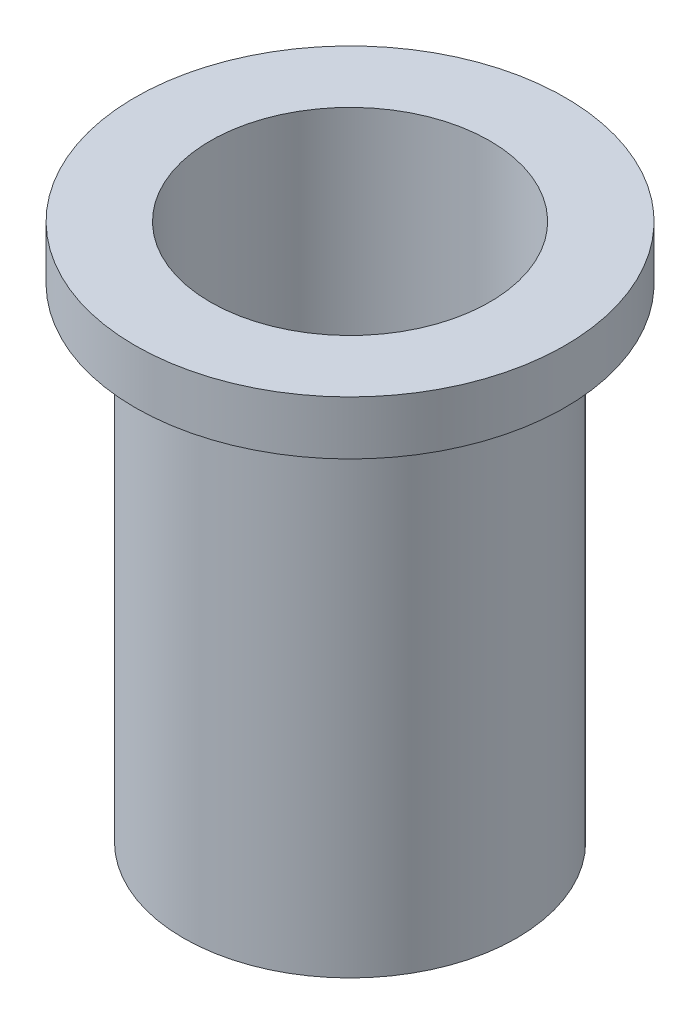
ISO-10303-21;
HEADER;
FILE_DESCRIPTION(('STEP AP214'),'2;1');
FILE_NAME('part.step','',(''),(''),'','','');
FILE_SCHEMA(('AUTOMOTIVE_DESIGN { 1 0 10303 214 1 1 1 1 }'));
ENDSEC;
DATA;
#1=APPLICATION_CONTEXT('core data for automotive mechanical design processes');
#2=APPLICATION_PROTOCOL_DEFINITION('international standard','automotive_design',2000,#1);
#3=PRODUCT_CONTEXT('',#1,'mechanical');
#4=PRODUCT('Part','Part','',(#3));
#5=PRODUCT_RELATED_PRODUCT_CATEGORY('part','',(#4));
#6=PRODUCT_DEFINITION_FORMATION('','',#4);
#7=PRODUCT_DEFINITION_CONTEXT('part definition',#1,'design');
#8=PRODUCT_DEFINITION('design','',#6,#7);
#9=PRODUCT_DEFINITION_SHAPE('','',#8);
#10=(LENGTH_UNIT() NAMED_UNIT(*) SI_UNIT(.MILLI.,.METRE.));
#11=(NAMED_UNIT(*) PLANE_ANGLE_UNIT() SI_UNIT($,.RADIAN.));
#12=(NAMED_UNIT(*) SI_UNIT($,.STERADIAN.) SOLID_ANGLE_UNIT());
#13=UNCERTAINTY_MEASURE_WITH_UNIT(LENGTH_MEASURE(1.E-05),#10,'distance_accuracy_value','');
#14=(GEOMETRIC_REPRESENTATION_CONTEXT(3) GLOBAL_UNCERTAINTY_ASSIGNED_CONTEXT((#13)) GLOBAL_UNIT_ASSIGNED_CONTEXT((#10,
#11,#12)) REPRESENTATION_CONTEXT('',''));
#15=CARTESIAN_POINT('',(0.,0.,0.));
#16=DIRECTION('',(0.,0.,1.));
#17=DIRECTION('',(1.,0.,0.));
#18=AXIS2_PLACEMENT_3D('',#15,#16,#17);
#19=CARTESIAN_POINT('',(0.,25.4,0.));
#20=DIRECTION('',(0.,-1.,0.));
#21=DIRECTION('',(0.,0.,-1.));
#22=AXIS2_PLACEMENT_3D('',#19,#20,#21);
#23=CYLINDRICAL_SURFACE('',#22,7.874);
#24=CARTESIAN_POINT('',(0.,0.,0.));
#25=DIRECTION('',(0.,1.,0.));
#26=DIRECTION('',(0.,0.,1.));
#27=AXIS2_PLACEMENT_3D('',#24,#25,#26);
#28=CIRCLE('',#27,7.874);
#29=CARTESIAN_POINT('',(0.,0.,7.874));
#30=VERTEX_POINT('',#29);
#31=EDGE_CURVE('E44',#30,#30,#28,.T.);
#32=ORIENTED_EDGE('',*,*,#31,.T.);
#33=EDGE_LOOP('',(#32));
#34=FACE_BOUND('',#33,.T.);
#35=CARTESIAN_POINT('',(0.,22.86,0.));
#36=DIRECTION('',(0.,1.,0.));
#37=DIRECTION('',(0.,0.,1.));
#38=AXIS2_PLACEMENT_3D('',#35,#36,#37);
#39=CIRCLE('',#38,7.874);
#40=CARTESIAN_POINT('',(0.,22.86,7.874));
#41=VERTEX_POINT('',#40);
#42=EDGE_CURVE('E11',#41,#41,#39,.T.);
#43=ORIENTED_EDGE('',*,*,#42,.F.);
#44=EDGE_LOOP('',(#43));
#45=FACE_BOUND('',#44,.T.);
#46=ADVANCED_FACE('F38',(#34,#45),#23,.T.);
#47=CARTESIAN_POINT('',(0.,25.4,0.));
#48=DIRECTION('',(0.,1.,0.));
#49=DIRECTION('',(0.,0.,1.));
#50=AXIS2_PLACEMENT_3D('',#47,#48,#49);
#51=PLANE('',#50);
#52=CARTESIAN_POINT('',(0.,25.4,0.));
#53=DIRECTION('',(0.,1.,0.));
#54=DIRECTION('',(0.,0.,1.));
#55=AXIS2_PLACEMENT_3D('',#52,#53,#54);
#56=CIRCLE('',#55,10.16);
#57=CARTESIAN_POINT('',(0.,25.4,10.16));
#58=VERTEX_POINT('',#57);
#59=EDGE_CURVE('E58',#58,#58,#56,.T.);
#60=ORIENTED_EDGE('',*,*,#59,.T.);
#61=EDGE_LOOP('',(#60));
#62=FACE_BOUND('',#61,.T.);
#63=CARTESIAN_POINT('',(0.,25.4,0.));
#64=DIRECTION('',(0.,1.,0.));
#65=DIRECTION('',(0.,0.,1.));
#66=AXIS2_PLACEMENT_3D('',#63,#64,#65);
#67=CIRCLE('',#66,6.604);
#68=CARTESIAN_POINT('',(0.,25.4,6.604));
#69=VERTEX_POINT('',#68);
#70=EDGE_CURVE('E48',#69,#69,#67,.T.);
#71=ORIENTED_EDGE('',*,*,#70,.F.);
#72=EDGE_LOOP('',(#71));
#73=FACE_BOUND('',#72,.T.);
#74=ADVANCED_FACE('F76',(#62,#73),#51,.T.);
#75=CARTESIAN_POINT('',(0.,0.,0.));
#76=DIRECTION('',(0.,1.,0.));
#77=DIRECTION('',(0.,0.,1.));
#78=AXIS2_PLACEMENT_3D('',#75,#76,#77);
#79=PLANE('',#78);
#80=ORIENTED_EDGE('',*,*,#31,.F.);
#81=EDGE_LOOP('',(#80));
#82=FACE_BOUND('',#81,.T.);
#83=CARTESIAN_POINT('',(0.,0.,0.));
#84=DIRECTION('',(0.,1.,0.));
#85=DIRECTION('',(0.,0.,1.));
#86=AXIS2_PLACEMENT_3D('',#83,#84,#85);
#87=CIRCLE('',#86,6.604);
#88=CARTESIAN_POINT('',(0.,0.,6.604));
#89=VERTEX_POINT('',#88);
#90=EDGE_CURVE('E52',#89,#89,#87,.T.);
#91=ORIENTED_EDGE('',*,*,#90,.T.);
#92=EDGE_LOOP('',(#91));
#93=FACE_BOUND('',#92,.T.);
#94=ADVANCED_FACE('F80',(#82,#93),#79,.F.);
#95=CARTESIAN_POINT('',(0.,25.4,0.));
#96=DIRECTION('',(0.,-1.,0.));
#97=DIRECTION('',(0.,0.,-1.));
#98=AXIS2_PLACEMENT_3D('',#95,#96,#97);
#99=CYLINDRICAL_SURFACE('',#98,6.604);
#100=ORIENTED_EDGE('',*,*,#70,.T.);
#101=EDGE_LOOP('',(#100));
#102=FACE_BOUND('',#101,.T.);
#103=ORIENTED_EDGE('',*,*,#90,.F.);
#104=EDGE_LOOP('',(#103));
#105=FACE_BOUND('',#104,.T.);
#106=ADVANCED_FACE('F73',(#102,#105),#99,.F.);
#107=CARTESIAN_POINT('',(0.,22.86,0.));
#108=DIRECTION('',(0.,1.,0.));
#109=DIRECTION('',(0.,0.,1.));
#110=AXIS2_PLACEMENT_3D('',#107,#108,#109);
#111=CYLINDRICAL_SURFACE('',#110,10.16);
#112=CARTESIAN_POINT('',(0.,22.86,0.));
#113=DIRECTION('',(0.,1.,0.));
#114=DIRECTION('',(0.,0.,1.));
#115=AXIS2_PLACEMENT_3D('',#112,#113,#114);
#116=CIRCLE('',#115,10.16);
#117=CARTESIAN_POINT('',(0.,22.86,10.16));
#118=VERTEX_POINT('',#117);
#119=EDGE_CURVE('E56',#118,#118,#116,.T.);
#120=ORIENTED_EDGE('',*,*,#119,.T.);
#121=EDGE_LOOP('',(#120));
#122=FACE_BOUND('',#121,.T.);
#123=ORIENTED_EDGE('',*,*,#59,.F.);
#124=EDGE_LOOP('',(#123));
#125=FACE_BOUND('',#124,.T.);
#126=ADVANCED_FACE('F64',(#122,#125),#111,.T.);
#127=CARTESIAN_POINT('',(0.,22.86,0.));
#128=DIRECTION('',(0.,1.,0.));
#129=DIRECTION('',(0.,0.,1.));
#130=AXIS2_PLACEMENT_3D('',#127,#128,#129);
#131=PLANE('',#130);
#132=ORIENTED_EDGE('',*,*,#42,.T.);
#133=EDGE_LOOP('',(#132));
#134=FACE_BOUND('',#133,.T.);
#135=ORIENTED_EDGE('',*,*,#119,.F.);
#136=EDGE_LOOP('',(#135));
#137=FACE_BOUND('',#136,.T.);
#138=ADVANCED_FACE('F67',(#134,#137),#131,.F.);
#139=CLOSED_SHELL('',(#46,#74,#94,#106,#126,#138));
#140=MANIFOLD_SOLID_BREP('B2',#139);
#141=ADVANCED_BREP_SHAPE_REPRESENTATION('',(#18,#140),#14);
#142=SHAPE_DEFINITION_REPRESENTATION(#9,#141);
ENDSEC;
END-ISO-10303-21;
